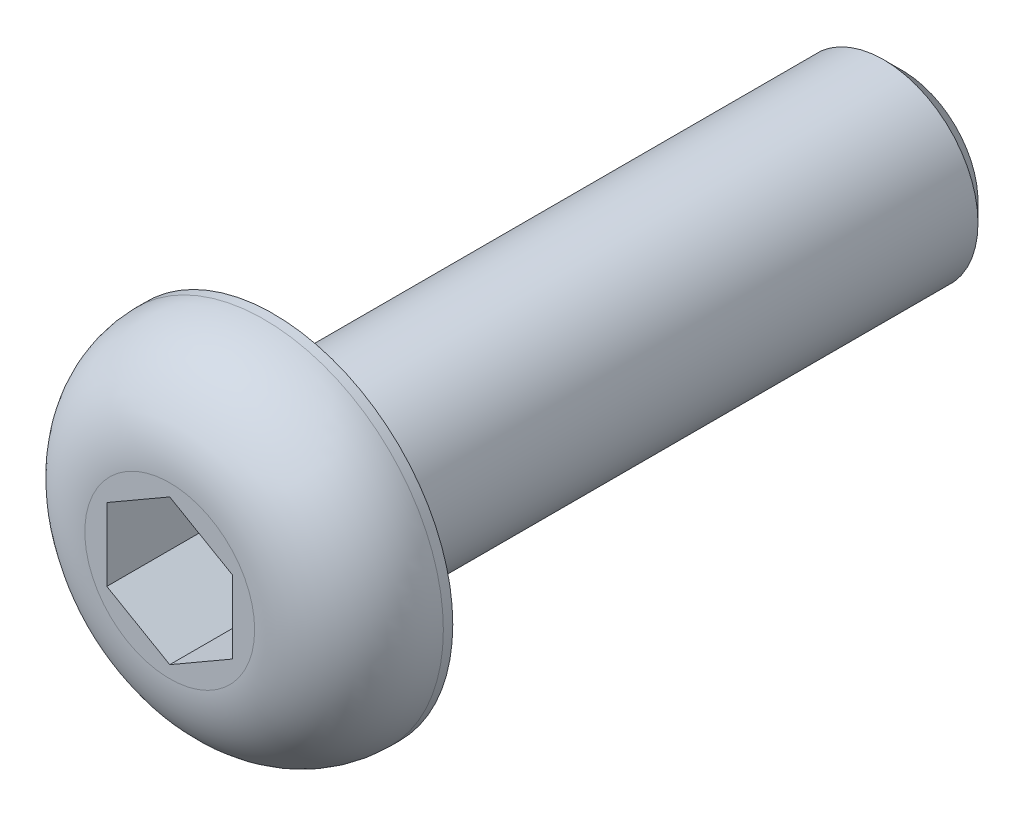
ISO-10303-21;
HEADER;
FILE_DESCRIPTION(('STEP AP214'),'2;1');
FILE_NAME('part.step','',(''),(''),'','','');
FILE_SCHEMA(('AUTOMOTIVE_DESIGN { 1 0 10303 214 1 1 1 1 }'));
ENDSEC;
DATA;
#1=APPLICATION_CONTEXT('core data for automotive mechanical design processes');
#2=APPLICATION_PROTOCOL_DEFINITION('international standard','automotive_design',2000,#1);
#3=PRODUCT_CONTEXT('',#1,'mechanical');
#4=PRODUCT('Part','Part','',(#3));
#5=PRODUCT_RELATED_PRODUCT_CATEGORY('part','',(#4));
#6=PRODUCT_DEFINITION_FORMATION('','',#4);
#7=PRODUCT_DEFINITION_CONTEXT('part definition',#1,'design');
#8=PRODUCT_DEFINITION('design','',#6,#7);
#9=PRODUCT_DEFINITION_SHAPE('','',#8);
#10=(LENGTH_UNIT() NAMED_UNIT(*) SI_UNIT(.MILLI.,.METRE.));
#11=(NAMED_UNIT(*) PLANE_ANGLE_UNIT() SI_UNIT($,.RADIAN.));
#12=(NAMED_UNIT(*) SI_UNIT($,.STERADIAN.) SOLID_ANGLE_UNIT());
#13=UNCERTAINTY_MEASURE_WITH_UNIT(LENGTH_MEASURE(1.E-05),#10,'distance_accuracy_value','');
#14=(GEOMETRIC_REPRESENTATION_CONTEXT(3) GLOBAL_UNCERTAINTY_ASSIGNED_CONTEXT((#13)) GLOBAL_UNIT_ASSIGNED_CONTEXT((#10,
#11,#12)) REPRESENTATION_CONTEXT('',''));
#15=CARTESIAN_POINT('',(0.,0.,0.));
#16=DIRECTION('',(0.,0.,1.));
#17=DIRECTION('',(1.,0.,0.));
#18=AXIS2_PLACEMENT_3D('',#15,#16,#17);
#19=CARTESIAN_POINT('',(0.,0.,0.));
#20=DIRECTION('',(0.,0.,1.));
#21=DIRECTION('',(1.,0.,0.));
#22=AXIS2_PLACEMENT_3D('',#19,#20,#21);
#23=PLANE('',#22);
#24=CARTESIAN_POINT('',(0.,0.,0.));
#25=DIRECTION('',(0.,0.,1.));
#26=DIRECTION('',(1.,0.,0.));
#27=AXIS2_PLACEMENT_3D('',#24,#25,#26);
#28=CIRCLE('',#27,2.85);
#29=CARTESIAN_POINT('',(2.85,0.,0.));
#30=VERTEX_POINT('',#29);
#31=EDGE_CURVE('E135',#30,#30,#28,.T.);
#32=ORIENTED_EDGE('',*,*,#31,.F.);
#33=EDGE_LOOP('',(#32));
#34=FACE_BOUND('',#33,.T.);
#35=CARTESIAN_POINT('',(0.,0.,0.));
#36=DIRECTION('',(0.,0.,1.));
#37=DIRECTION('',(1.,0.,0.));
#38=AXIS2_PLACEMENT_3D('',#35,#36,#37);
#39=CIRCLE('',#38,1.5);
#40=CARTESIAN_POINT('',(1.5,0.,0.));
#41=VERTEX_POINT('',#40);
#42=EDGE_CURVE('E143',#41,#41,#39,.F.);
#43=ORIENTED_EDGE('',*,*,#42,.F.);
#44=EDGE_LOOP('',(#43));
#45=FACE_BOUND('',#44,.T.);
#46=ADVANCED_FACE('F33',(#34,#45),#23,.F.);
#47=CARTESIAN_POINT('',(0.,0.,1.65));
#48=DIRECTION('',(0.,0.,-1.));
#49=DIRECTION('',(-1.,0.,0.));
#50=AXIS2_PLACEMENT_3D('',#47,#48,#49);
#51=CYLINDRICAL_SURFACE('',#50,2.85);
#52=CARTESIAN_POINT('',(0.,0.,0.15));
#53=DIRECTION('',(0.,0.,1.));
#54=DIRECTION('',(1.,0.,0.));
#55=AXIS2_PLACEMENT_3D('',#52,#53,#54);
#56=CIRCLE('',#55,2.85);
#57=CARTESIAN_POINT('',(2.85,0.,0.15));
#58=VERTEX_POINT('',#57);
#59=EDGE_CURVE('E11',#58,#58,#56,.F.);
#60=ORIENTED_EDGE('',*,*,#59,.T.);
#61=EDGE_LOOP('',(#60));
#62=FACE_BOUND('',#61,.T.);
#63=ORIENTED_EDGE('',*,*,#31,.T.);
#64=EDGE_LOOP('',(#63));
#65=FACE_BOUND('',#64,.T.);
#66=ADVANCED_FACE('F166',(#62,#65),#51,.T.);
#67=CARTESIAN_POINT('',(0.,0.,1.65));
#68=DIRECTION('',(0.,0.,1.));
#69=DIRECTION('',(1.,0.,0.));
#70=AXIS2_PLACEMENT_3D('',#67,#68,#69);
#71=PLANE('',#70);
#72=CARTESIAN_POINT('',(0.,0.,1.65));
#73=DIRECTION('',(0.,0.,1.));
#74=DIRECTION('',(1.,0.,0.));
#75=AXIS2_PLACEMENT_3D('',#72,#73,#74);
#76=CIRCLE('',#75,1.35);
#77=CARTESIAN_POINT('',(1.35,0.,1.65));
#78=VERTEX_POINT('',#77);
#79=EDGE_CURVE('E41',#78,#78,#76,.T.);
#80=ORIENTED_EDGE('',*,*,#79,.T.);
#81=EDGE_LOOP('',(#80));
#82=FACE_BOUND('',#81,.T.);
#83=DIRECTION('',(-0.866025403784439,0.5,0.));
#84=VECTOR('',#83,1.);
#85=CARTESIAN_POINT('',(1.,0.577350269189626,1.65));
#86=LINE('',#85,#84);
#87=CARTESIAN_POINT('',(1.,0.577350269189626,1.65));
#88=VERTEX_POINT('',#87);
#89=CARTESIAN_POINT('',(0.,1.15470053837925,1.65));
#90=VERTEX_POINT('',#89);
#91=EDGE_CURVE('E48',#88,#90,#86,.T.);
#92=ORIENTED_EDGE('',*,*,#91,.F.);
#93=DIRECTION('',(0.,1.,0.));
#94=VECTOR('',#93,1.);
#95=CARTESIAN_POINT('',(1.,-0.577350269189626,1.65));
#96=LINE('',#95,#94);
#97=CARTESIAN_POINT('',(1.,-0.577350269189626,1.65));
#98=VERTEX_POINT('',#97);
#99=EDGE_CURVE('E131',#98,#88,#96,.T.);
#100=ORIENTED_EDGE('',*,*,#99,.F.);
#101=DIRECTION('',(0.866025403784439,0.5,0.));
#102=VECTOR('',#101,1.);
#103=CARTESIAN_POINT('',(0.,-1.15470053837925,1.65));
#104=LINE('',#103,#102);
#105=CARTESIAN_POINT('',(0.,-1.15470053837925,1.65));
#106=VERTEX_POINT('',#105);
#107=EDGE_CURVE('E129',#106,#98,#104,.T.);
#108=ORIENTED_EDGE('',*,*,#107,.F.);
#109=DIRECTION('',(0.866025403784439,-0.5,0.));
#110=VECTOR('',#109,1.);
#111=CARTESIAN_POINT('',(-1.,-0.577350269189626,1.65));
#112=LINE('',#111,#110);
#113=CARTESIAN_POINT('',(-1.,-0.577350269189626,1.65));
#114=VERTEX_POINT('',#113);
#115=EDGE_CURVE('E96',#114,#106,#112,.T.);
#116=ORIENTED_EDGE('',*,*,#115,.F.);
#117=DIRECTION('',(0.,-1.,0.));
#118=VECTOR('',#117,1.);
#119=CARTESIAN_POINT('',(-1.,0.577350269189626,1.65));
#120=LINE('',#119,#118);
#121=CARTESIAN_POINT('',(-1.,0.577350269189626,1.65));
#122=VERTEX_POINT('',#121);
#123=EDGE_CURVE('E125',#122,#114,#120,.T.);
#124=ORIENTED_EDGE('',*,*,#123,.F.);
#125=DIRECTION('',(-0.866025403784439,-0.5,0.));
#126=VECTOR('',#125,1.);
#127=CARTESIAN_POINT('',(0.,1.15470053837925,1.65));
#128=LINE('',#127,#126);
#129=EDGE_CURVE('E122',#90,#122,#128,.T.);
#130=ORIENTED_EDGE('',*,*,#129,.F.);
#131=EDGE_LOOP('',(#92,#100,#108,#116,#124,#130));
#132=FACE_BOUND('',#131,.T.);
#133=ADVANCED_FACE('F154',(#82,#132),#71,.T.);
#134=CARTESIAN_POINT('',(0.,0.,-10.));
#135=DIRECTION('',(0.,0.,1.));
#136=DIRECTION('',(1.,0.,0.));
#137=AXIS2_PLACEMENT_3D('',#134,#135,#136);
#138=CYLINDRICAL_SURFACE('',#137,1.5);
#139=CARTESIAN_POINT('',(0.,0.,-9.7));
#140=DIRECTION('',(0.,0.,-1.));
#141=DIRECTION('',(-1.,0.,0.));
#142=AXIS2_PLACEMENT_3D('',#139,#140,#141);
#143=CIRCLE('',#142,1.5);
#144=CARTESIAN_POINT('',(-1.5,0.,-9.7));
#145=VERTEX_POINT('',#144);
#146=EDGE_CURVE('E149',#145,#145,#143,.F.);
#147=ORIENTED_EDGE('',*,*,#146,.T.);
#148=EDGE_LOOP('',(#147));
#149=FACE_BOUND('',#148,.T.);
#150=ORIENTED_EDGE('',*,*,#42,.T.);
#151=EDGE_LOOP('',(#150));
#152=FACE_BOUND('',#151,.T.);
#153=ADVANCED_FACE('F189',(#149,#152),#138,.T.);
#154=CARTESIAN_POINT('',(0.,0.,-10.));
#155=DIRECTION('',(0.,0.,-1.));
#156=DIRECTION('',(-1.,0.,0.));
#157=AXIS2_PLACEMENT_3D('',#154,#155,#156);
#158=PLANE('',#157);
#159=CARTESIAN_POINT('',(0.,0.,-10.));
#160=DIRECTION('',(0.,0.,-1.));
#161=DIRECTION('',(-1.,0.,0.));
#162=AXIS2_PLACEMENT_3D('',#159,#160,#161);
#163=CIRCLE('',#162,1.2);
#164=CARTESIAN_POINT('',(-1.2,0.,-10.));
#165=VERTEX_POINT('',#164);
#166=EDGE_CURVE('E146',#165,#165,#163,.T.);
#167=ORIENTED_EDGE('',*,*,#166,.T.);
#168=EDGE_LOOP('',(#167));
#169=FACE_BOUND('',#168,.T.);
#170=ADVANCED_FACE('F181',(#169),#158,.T.);
#171=CARTESIAN_POINT('',(0.,0.,-10.));
#172=DIRECTION('',(0.,0.,1.));
#173=DIRECTION('',(1.,0.,0.));
#174=AXIS2_PLACEMENT_3D('',#171,#172,#173);
#175=CONICAL_SURFACE('',#174,1.2,0.785398163397447);
#176=ORIENTED_EDGE('',*,*,#146,.F.);
#177=EDGE_LOOP('',(#176));
#178=FACE_BOUND('',#177,.T.);
#179=ORIENTED_EDGE('',*,*,#166,.F.);
#180=EDGE_LOOP('',(#179));
#181=FACE_BOUND('',#180,.T.);
#182=ADVANCED_FACE('F178',(#178,#181),#175,.T.);
#183=CARTESIAN_POINT('',(1.,0.577350269189626,-0.35));
#184=DIRECTION('',(0.5,0.866025403784439,0.));
#185=DIRECTION('',(-0.866025403784439,0.5,0.));
#186=AXIS2_PLACEMENT_3D('',#183,#184,#185);
#187=PLANE('',#186);
#188=ORIENTED_EDGE('',*,*,#91,.T.);
#189=DIRECTION('',(0.,0.,1.));
#190=VECTOR('',#189,1.);
#191=CARTESIAN_POINT('',(0.,1.15470053837925,-0.35));
#192=LINE('',#191,#190);
#193=CARTESIAN_POINT('',(0.,1.15470053837925,-0.35));
#194=VERTEX_POINT('',#193);
#195=EDGE_CURVE('E78',#194,#90,#192,.T.);
#196=ORIENTED_EDGE('',*,*,#195,.F.);
#197=DIRECTION('',(-0.866025403784439,0.5,0.));
#198=VECTOR('',#197,1.);
#199=CARTESIAN_POINT('',(1.,0.577350269189626,-0.35));
#200=LINE('',#199,#198);
#201=CARTESIAN_POINT('',(1.,0.577350269189626,-0.35));
#202=VERTEX_POINT('',#201);
#203=EDGE_CURVE('E133',#202,#194,#200,.T.);
#204=ORIENTED_EDGE('',*,*,#203,.F.);
#205=DIRECTION('',(0.,0.,1.));
#206=VECTOR('',#205,1.);
#207=CARTESIAN_POINT('',(1.,0.577350269189626,-0.35));
#208=LINE('',#207,#206);
#209=EDGE_CURVE('E56',#202,#88,#208,.T.);
#210=ORIENTED_EDGE('',*,*,#209,.T.);
#211=EDGE_LOOP('',(#188,#196,#204,#210));
#212=FACE_BOUND('',#211,.T.);
#213=ADVANCED_FACE('F180',(#212),#187,.F.);
#214=CARTESIAN_POINT('',(1.,-0.577350269189626,-0.35));
#215=DIRECTION('',(1.,0.,0.));
#216=DIRECTION('',(0.,1.,0.));
#217=AXIS2_PLACEMENT_3D('',#214,#215,#216);
#218=PLANE('',#217);
#219=ORIENTED_EDGE('',*,*,#99,.T.);
#220=ORIENTED_EDGE('',*,*,#209,.F.);
#221=DIRECTION('',(0.,1.,0.));
#222=VECTOR('',#221,1.);
#223=CARTESIAN_POINT('',(1.,-0.577350269189626,-0.35));
#224=LINE('',#223,#222);
#225=CARTESIAN_POINT('',(1.,-0.577350269189626,-0.35));
#226=VERTEX_POINT('',#225);
#227=EDGE_CURVE('E108',#226,#202,#224,.T.);
#228=ORIENTED_EDGE('',*,*,#227,.F.);
#229=DIRECTION('',(0.,0.,1.));
#230=VECTOR('',#229,1.);
#231=CARTESIAN_POINT('',(1.,-0.577350269189626,-0.35));
#232=LINE('',#231,#230);
#233=EDGE_CURVE('E100',#226,#98,#232,.T.);
#234=ORIENTED_EDGE('',*,*,#233,.T.);
#235=EDGE_LOOP('',(#219,#220,#228,#234));
#236=FACE_BOUND('',#235,.T.);
#237=ADVANCED_FACE('F187',(#236),#218,.F.);
#238=CARTESIAN_POINT('',(0.,-1.15470053837925,-0.35));
#239=DIRECTION('',(0.5,-0.866025403784439,0.));
#240=DIRECTION('',(0.866025403784439,0.5,0.));
#241=AXIS2_PLACEMENT_3D('',#238,#239,#240);
#242=PLANE('',#241);
#243=ORIENTED_EDGE('',*,*,#107,.T.);
#244=ORIENTED_EDGE('',*,*,#233,.F.);
#245=DIRECTION('',(0.866025403784439,0.5,0.));
#246=VECTOR('',#245,1.);
#247=CARTESIAN_POINT('',(0.,-1.15470053837925,-0.35));
#248=LINE('',#247,#246);
#249=CARTESIAN_POINT('',(0.,-1.15470053837925,-0.35));
#250=VERTEX_POINT('',#249);
#251=EDGE_CURVE('E104',#250,#226,#248,.T.);
#252=ORIENTED_EDGE('',*,*,#251,.F.);
#253=DIRECTION('',(0.,0.,1.));
#254=VECTOR('',#253,1.);
#255=CARTESIAN_POINT('',(0.,-1.15470053837925,-0.35));
#256=LINE('',#255,#254);
#257=EDGE_CURVE('E89',#250,#106,#256,.T.);
#258=ORIENTED_EDGE('',*,*,#257,.T.);
#259=EDGE_LOOP('',(#243,#244,#252,#258));
#260=FACE_BOUND('',#259,.T.);
#261=ADVANCED_FACE('F105',(#260),#242,.F.);
#262=CARTESIAN_POINT('',(-1.,-0.577350269189626,-0.35));
#263=DIRECTION('',(-0.5,-0.866025403784439,0.));
#264=DIRECTION('',(0.866025403784439,-0.5,0.));
#265=AXIS2_PLACEMENT_3D('',#262,#263,#264);
#266=PLANE('',#265);
#267=ORIENTED_EDGE('',*,*,#115,.T.);
#268=ORIENTED_EDGE('',*,*,#257,.F.);
#269=DIRECTION('',(0.866025403784439,-0.5,0.));
#270=VECTOR('',#269,1.);
#271=CARTESIAN_POINT('',(-1.,-0.577350269189626,-0.35));
#272=LINE('',#271,#270);
#273=CARTESIAN_POINT('',(-1.,-0.577350269189626,-0.35));
#274=VERTEX_POINT('',#273);
#275=EDGE_CURVE('E93',#274,#250,#272,.T.);
#276=ORIENTED_EDGE('',*,*,#275,.F.);
#277=DIRECTION('',(0.,0.,1.));
#278=VECTOR('',#277,1.);
#279=CARTESIAN_POINT('',(-1.,-0.577350269189626,-0.35));
#280=LINE('',#279,#278);
#281=EDGE_CURVE('E101',#274,#114,#280,.T.);
#282=ORIENTED_EDGE('',*,*,#281,.T.);
#283=EDGE_LOOP('',(#267,#268,#276,#282));
#284=FACE_BOUND('',#283,.T.);
#285=ADVANCED_FACE('F91',(#284),#266,.F.);
#286=CARTESIAN_POINT('',(-1.,0.577350269189626,-0.35));
#287=DIRECTION('',(-1.,0.,0.));
#288=DIRECTION('',(0.,-1.,0.));
#289=AXIS2_PLACEMENT_3D('',#286,#287,#288);
#290=PLANE('',#289);
#291=ORIENTED_EDGE('',*,*,#123,.T.);
#292=ORIENTED_EDGE('',*,*,#281,.F.);
#293=DIRECTION('',(0.,-1.,0.));
#294=VECTOR('',#293,1.);
#295=CARTESIAN_POINT('',(-1.,0.577350269189626,-0.35));
#296=LINE('',#295,#294);
#297=CARTESIAN_POINT('',(-1.,0.577350269189626,-0.35));
#298=VERTEX_POINT('',#297);
#299=EDGE_CURVE('E114',#298,#274,#296,.T.);
#300=ORIENTED_EDGE('',*,*,#299,.F.);
#301=DIRECTION('',(0.,0.,1.));
#302=VECTOR('',#301,1.);
#303=CARTESIAN_POINT('',(-1.,0.577350269189626,-0.35));
#304=LINE('',#303,#302);
#305=EDGE_CURVE('E138',#298,#122,#304,.T.);
#306=ORIENTED_EDGE('',*,*,#305,.T.);
#307=EDGE_LOOP('',(#291,#292,#300,#306));
#308=FACE_BOUND('',#307,.T.);
#309=ADVANCED_FACE('F205',(#308),#290,.F.);
#310=CARTESIAN_POINT('',(0.,1.15470053837925,-0.35));
#311=DIRECTION('',(-0.5,0.866025403784439,0.));
#312=DIRECTION('',(-0.866025403784439,-0.5,0.));
#313=AXIS2_PLACEMENT_3D('',#310,#311,#312);
#314=PLANE('',#313);
#315=ORIENTED_EDGE('',*,*,#129,.T.);
#316=ORIENTED_EDGE('',*,*,#305,.F.);
#317=DIRECTION('',(-0.866025403784439,-0.5,0.));
#318=VECTOR('',#317,1.);
#319=CARTESIAN_POINT('',(0.,1.15470053837925,-0.35));
#320=LINE('',#319,#318);
#321=EDGE_CURVE('E116',#194,#298,#320,.T.);
#322=ORIENTED_EDGE('',*,*,#321,.F.);
#323=ORIENTED_EDGE('',*,*,#195,.T.);
#324=EDGE_LOOP('',(#315,#316,#322,#323));
#325=FACE_BOUND('',#324,.T.);
#326=ADVANCED_FACE('F162',(#325),#314,.F.);
#327=CARTESIAN_POINT('',(0.,0.,-0.35));
#328=DIRECTION('',(0.,0.,1.));
#329=DIRECTION('',(1.,0.,0.));
#330=AXIS2_PLACEMENT_3D('',#327,#328,#329);
#331=PLANE('',#330);
#332=ORIENTED_EDGE('',*,*,#203,.T.);
#333=ORIENTED_EDGE('',*,*,#321,.T.);
#334=ORIENTED_EDGE('',*,*,#299,.T.);
#335=ORIENTED_EDGE('',*,*,#275,.T.);
#336=ORIENTED_EDGE('',*,*,#251,.T.);
#337=ORIENTED_EDGE('',*,*,#227,.T.);
#338=EDGE_LOOP('',(#332,#333,#334,#335,#336,#337));
#339=FACE_BOUND('',#338,.T.);
#340=ADVANCED_FACE('F111',(#339),#331,.T.);
#341=CARTESIAN_POINT('',(0.,0.,0.15));
#342=DIRECTION('',(0.,0.,1.));
#343=DIRECTION('',(1.,0.,0.));
#344=AXIS2_PLACEMENT_3D('',#341,#342,#343);
#345=DEGENERATE_TOROIDAL_SURFACE('',#344,1.35,1.5,.T.);
#346=ORIENTED_EDGE('',*,*,#59,.F.);
#347=EDGE_LOOP('',(#346));
#348=FACE_BOUND('',#347,.T.);
#349=ORIENTED_EDGE('',*,*,#79,.F.);
#350=EDGE_LOOP('',(#349));
#351=FACE_BOUND('',#350,.T.);
#352=ADVANCED_FACE('F35',(#348,#351),#345,.T.);
#353=CLOSED_SHELL('',(#46,#66,#133,#153,#170,#182,#213,#237,#261,#285,#309,#326,#340,#352));
#354=MANIFOLD_SOLID_BREP('B2',#353);
#355=ADVANCED_BREP_SHAPE_REPRESENTATION('',(#18,#354),#14);
#356=SHAPE_DEFINITION_REPRESENTATION(#9,#355);
ENDSEC;
END-ISO-10303-21;
